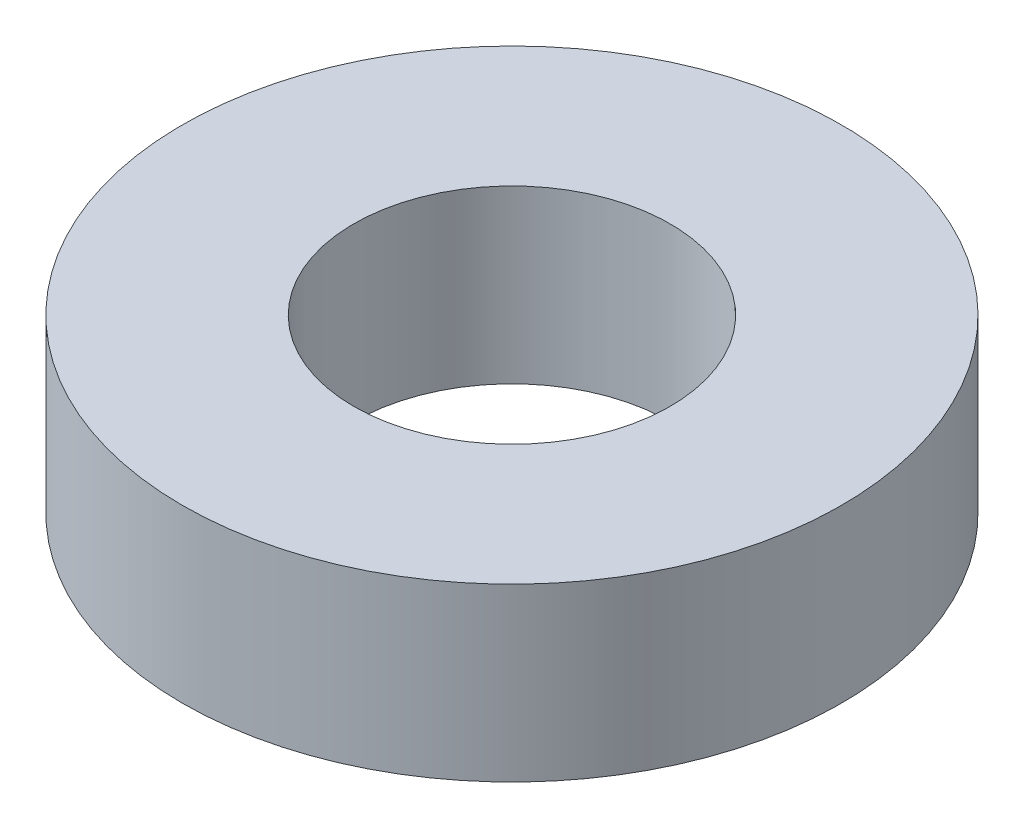
ISO-10303-21;
HEADER;
FILE_DESCRIPTION(('STEP AP214'),'2;1');
FILE_NAME('part.step','',(''),(''),'','','');
FILE_SCHEMA(('AUTOMOTIVE_DESIGN { 1 0 10303 214 1 1 1 1 }'));
ENDSEC;
DATA;
#1=APPLICATION_CONTEXT('core data for automotive mechanical design processes');
#2=APPLICATION_PROTOCOL_DEFINITION('international standard','automotive_design',2000,#1);
#3=PRODUCT_CONTEXT('',#1,'mechanical');
#4=PRODUCT('Part','Part','',(#3));
#5=PRODUCT_RELATED_PRODUCT_CATEGORY('part','',(#4));
#6=PRODUCT_DEFINITION_FORMATION('','',#4);
#7=PRODUCT_DEFINITION_CONTEXT('part definition',#1,'design');
#8=PRODUCT_DEFINITION('design','',#6,#7);
#9=PRODUCT_DEFINITION_SHAPE('','',#8);
#10=(LENGTH_UNIT() NAMED_UNIT(*) SI_UNIT(.MILLI.,.METRE.));
#11=(NAMED_UNIT(*) PLANE_ANGLE_UNIT() SI_UNIT($,.RADIAN.));
#12=(NAMED_UNIT(*) SI_UNIT($,.STERADIAN.) SOLID_ANGLE_UNIT());
#13=UNCERTAINTY_MEASURE_WITH_UNIT(LENGTH_MEASURE(1.E-05),#10,'distance_accuracy_value','');
#14=(GEOMETRIC_REPRESENTATION_CONTEXT(3) GLOBAL_UNCERTAINTY_ASSIGNED_CONTEXT((#13)) GLOBAL_UNIT_ASSIGNED_CONTEXT((#10,
#11,#12)) REPRESENTATION_CONTEXT('',''));
#15=CARTESIAN_POINT('',(0.,0.,0.));
#16=DIRECTION('',(0.,0.,1.));
#17=DIRECTION('',(1.,0.,0.));
#18=AXIS2_PLACEMENT_3D('',#15,#16,#17);
#19=CARTESIAN_POINT('',(0.,3.175,0.));
#20=DIRECTION('',(0.,1.,0.));
#21=DIRECTION('',(0.,0.,1.));
#22=AXIS2_PLACEMENT_3D('',#19,#20,#21);
#23=PLANE('',#22);
#24=CARTESIAN_POINT('',(0.,3.175,0.));
#25=DIRECTION('',(0.,1.,0.));
#26=DIRECTION('',(0.,0.,1.));
#27=AXIS2_PLACEMENT_3D('',#24,#25,#26);
#28=CIRCLE('',#27,6.10576923076923);
#29=CARTESIAN_POINT('',(0.,3.175,6.10576923076923));
#30=VERTEX_POINT('',#29);
#31=EDGE_CURVE('E10',#30,#30,#28,.T.);
#32=ORIENTED_EDGE('',*,*,#31,.T.);
#33=EDGE_LOOP('',(#32));
#34=FACE_BOUND('',#33,.T.);
#35=CARTESIAN_POINT('',(0.,3.175,0.));
#36=DIRECTION('',(0.,1.,0.));
#37=DIRECTION('',(0.,0.,1.));
#38=AXIS2_PLACEMENT_3D('',#35,#36,#37);
#39=CIRCLE('',#38,2.93076923076923);
#40=CARTESIAN_POINT('',(0.,3.175,2.93076923076923));
#41=VERTEX_POINT('',#40);
#42=EDGE_CURVE('E50',#41,#41,#39,.T.);
#43=ORIENTED_EDGE('',*,*,#42,.F.);
#44=EDGE_LOOP('',(#43));
#45=FACE_BOUND('',#44,.T.);
#46=ADVANCED_FACE('F37',(#34,#45),#23,.T.);
#47=CARTESIAN_POINT('',(0.,0.,0.));
#48=DIRECTION('',(0.,1.,0.));
#49=DIRECTION('',(0.,0.,1.));
#50=AXIS2_PLACEMENT_3D('',#47,#48,#49);
#51=PLANE('',#50);
#52=CARTESIAN_POINT('',(0.,0.,0.));
#53=DIRECTION('',(0.,1.,0.));
#54=DIRECTION('',(0.,0.,1.));
#55=AXIS2_PLACEMENT_3D('',#52,#53,#54);
#56=CIRCLE('',#55,6.10576923076923);
#57=CARTESIAN_POINT('',(0.,0.,6.10576923076923));
#58=VERTEX_POINT('',#57);
#59=EDGE_CURVE('E41',#58,#58,#56,.T.);
#60=ORIENTED_EDGE('',*,*,#59,.F.);
#61=EDGE_LOOP('',(#60));
#62=FACE_BOUND('',#61,.T.);
#63=CARTESIAN_POINT('',(0.,0.,0.));
#64=DIRECTION('',(0.,1.,0.));
#65=DIRECTION('',(0.,0.,1.));
#66=AXIS2_PLACEMENT_3D('',#63,#64,#65);
#67=CIRCLE('',#66,2.93076923076923);
#68=CARTESIAN_POINT('',(0.,0.,2.93076923076923));
#69=VERTEX_POINT('',#68);
#70=EDGE_CURVE('E52',#69,#69,#67,.T.);
#71=ORIENTED_EDGE('',*,*,#70,.T.);
#72=EDGE_LOOP('',(#71));
#73=FACE_BOUND('',#72,.T.);
#74=ADVANCED_FACE('F64',(#62,#73),#51,.F.);
#75=CARTESIAN_POINT('',(0.,3.175,0.));
#76=DIRECTION('',(0.,-1.,0.));
#77=DIRECTION('',(0.,0.,-1.));
#78=AXIS2_PLACEMENT_3D('',#75,#76,#77);
#79=CYLINDRICAL_SURFACE('',#78,6.10576923076923);
#80=ORIENTED_EDGE('',*,*,#31,.F.);
#81=EDGE_LOOP('',(#80));
#82=FACE_BOUND('',#81,.T.);
#83=ORIENTED_EDGE('',*,*,#59,.T.);
#84=EDGE_LOOP('',(#83));
#85=FACE_BOUND('',#84,.T.);
#86=ADVANCED_FACE('F39',(#82,#85),#79,.T.);
#87=CARTESIAN_POINT('',(0.,3.175,0.));
#88=DIRECTION('',(0.,-1.,0.));
#89=DIRECTION('',(0.,0.,-1.));
#90=AXIS2_PLACEMENT_3D('',#87,#88,#89);
#91=CYLINDRICAL_SURFACE('',#90,2.93076923076923);
#92=ORIENTED_EDGE('',*,*,#42,.T.);
#93=EDGE_LOOP('',(#92));
#94=FACE_BOUND('',#93,.T.);
#95=ORIENTED_EDGE('',*,*,#70,.F.);
#96=EDGE_LOOP('',(#95));
#97=FACE_BOUND('',#96,.T.);
#98=ADVANCED_FACE('F60',(#94,#97),#91,.F.);
#99=CLOSED_SHELL('',(#46,#74,#86,#98));
#100=MANIFOLD_SOLID_BREP('B2',#99);
#101=ADVANCED_BREP_SHAPE_REPRESENTATION('',(#18,#100),#14);
#102=SHAPE_DEFINITION_REPRESENTATION(#9,#101);
ENDSEC;
END-ISO-10303-21;
